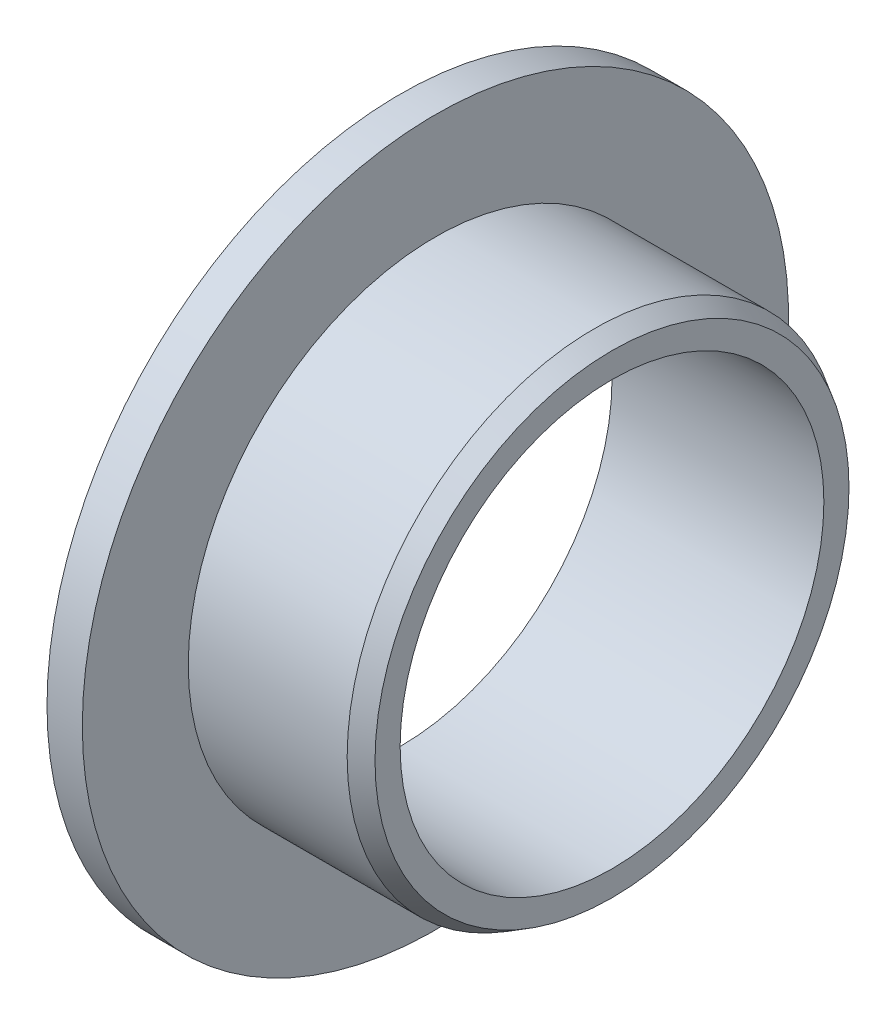
ISO-10303-21;
HEADER;
FILE_DESCRIPTION(('STEP AP214'),'2;1');
FILE_NAME('part.step','',(''),(''),'','','');
FILE_SCHEMA(('AUTOMOTIVE_DESIGN { 1 0 10303 214 1 1 1 1 }'));
ENDSEC;
DATA;
#1=APPLICATION_CONTEXT('core data for automotive mechanical design processes');
#2=APPLICATION_PROTOCOL_DEFINITION('international standard','automotive_design',2000,#1);
#3=PRODUCT_CONTEXT('',#1,'mechanical');
#4=PRODUCT('Part','Part','',(#3));
#5=PRODUCT_RELATED_PRODUCT_CATEGORY('part','',(#4));
#6=PRODUCT_DEFINITION_FORMATION('','',#4);
#7=PRODUCT_DEFINITION_CONTEXT('part definition',#1,'design');
#8=PRODUCT_DEFINITION('design','',#6,#7);
#9=PRODUCT_DEFINITION_SHAPE('','',#8);
#10=(LENGTH_UNIT() NAMED_UNIT(*) SI_UNIT(.MILLI.,.METRE.));
#11=(NAMED_UNIT(*) PLANE_ANGLE_UNIT() SI_UNIT($,.RADIAN.));
#12=(NAMED_UNIT(*) SI_UNIT($,.STERADIAN.) SOLID_ANGLE_UNIT());
#13=UNCERTAINTY_MEASURE_WITH_UNIT(LENGTH_MEASURE(1.E-05),#10,'distance_accuracy_value','');
#14=(GEOMETRIC_REPRESENTATION_CONTEXT(3) GLOBAL_UNCERTAINTY_ASSIGNED_CONTEXT((#13)) GLOBAL_UNIT_ASSIGNED_CONTEXT((#10,
#11,#12)) REPRESENTATION_CONTEXT('',''));
#15=CARTESIAN_POINT('',(0.,0.,0.));
#16=DIRECTION('',(0.,0.,1.));
#17=DIRECTION('',(1.,0.,0.));
#18=AXIS2_PLACEMENT_3D('',#15,#16,#17);
#19=CARTESIAN_POINT('',(0.,6.,0.));
#20=DIRECTION('',(1.,0.,0.));
#21=DIRECTION('',(0.,0.,-1.));
#22=AXIS2_PLACEMENT_3D('',#19,#20,#21);
#23=PLANE('',#22);
#24=CARTESIAN_POINT('',(0.,0.,0.));
#25=DIRECTION('',(-1.,0.,0.));
#26=DIRECTION('',(0.,0.,1.));
#27=AXIS2_PLACEMENT_3D('',#24,#25,#26);
#28=CIRCLE('',#27,6.);
#29=CARTESIAN_POINT('',(0.,0.,6.));
#30=VERTEX_POINT('',#29);
#31=EDGE_CURVE('E65',#30,#30,#28,.T.);
#32=ORIENTED_EDGE('',*,*,#31,.F.);
#33=EDGE_LOOP('',(#32));
#34=FACE_BOUND('',#33,.T.);
#35=CARTESIAN_POINT('',(0.,0.,0.));
#36=DIRECTION('',(-1.,0.,0.));
#37=DIRECTION('',(0.,0.,1.));
#38=AXIS2_PLACEMENT_3D('',#35,#36,#37);
#39=CIRCLE('',#38,10.);
#40=CARTESIAN_POINT('',(0.,0.,10.));
#41=VERTEX_POINT('',#40);
#42=EDGE_CURVE('E50',#41,#41,#39,.T.);
#43=ORIENTED_EDGE('',*,*,#42,.T.);
#44=EDGE_LOOP('',(#43));
#45=FACE_BOUND('',#44,.T.);
#46=ADVANCED_FACE('F38',(#34,#45),#23,.F.);
#47=CARTESIAN_POINT('',(0.,0.,0.));
#48=DIRECTION('',(-1.,0.,0.));
#49=DIRECTION('',(0.,0.,1.));
#50=AXIS2_PLACEMENT_3D('',#47,#48,#49);
#51=CYLINDRICAL_SURFACE('',#50,10.);
#52=ORIENTED_EDGE('',*,*,#42,.F.);
#53=EDGE_LOOP('',(#52));
#54=FACE_BOUND('',#53,.T.);
#55=CARTESIAN_POINT('',(1.,0.,0.));
#56=DIRECTION('',(-1.,0.,0.));
#57=DIRECTION('',(0.,0.,1.));
#58=AXIS2_PLACEMENT_3D('',#55,#56,#57);
#59=CIRCLE('',#58,10.);
#60=CARTESIAN_POINT('',(1.,0.,10.));
#61=VERTEX_POINT('',#60);
#62=EDGE_CURVE('E54',#61,#61,#59,.T.);
#63=ORIENTED_EDGE('',*,*,#62,.T.);
#64=EDGE_LOOP('',(#63));
#65=FACE_BOUND('',#64,.T.);
#66=ADVANCED_FACE('F73',(#54,#65),#51,.T.);
#67=CARTESIAN_POINT('',(1.,10.,0.));
#68=DIRECTION('',(-1.,0.,0.));
#69=DIRECTION('',(0.,0.,1.));
#70=AXIS2_PLACEMENT_3D('',#67,#68,#69);
#71=PLANE('',#70);
#72=ORIENTED_EDGE('',*,*,#62,.F.);
#73=EDGE_LOOP('',(#72));
#74=FACE_BOUND('',#73,.T.);
#75=CARTESIAN_POINT('',(1.,0.,0.));
#76=DIRECTION('',(-1.,0.,0.));
#77=DIRECTION('',(0.,0.,1.));
#78=AXIS2_PLACEMENT_3D('',#75,#76,#77);
#79=CIRCLE('',#78,7.);
#80=CARTESIAN_POINT('',(1.,0.,7.));
#81=VERTEX_POINT('',#80);
#82=EDGE_CURVE('E59',#81,#81,#79,.T.);
#83=ORIENTED_EDGE('',*,*,#82,.T.);
#84=EDGE_LOOP('',(#83));
#85=FACE_BOUND('',#84,.T.);
#86=ADVANCED_FACE('F78',(#74,#85),#71,.F.);
#87=CARTESIAN_POINT('',(0.,0.,0.));
#88=DIRECTION('',(-1.,0.,0.));
#89=DIRECTION('',(0.,0.,1.));
#90=AXIS2_PLACEMENT_3D('',#87,#88,#89);
#91=CYLINDRICAL_SURFACE('',#90,7.);
#92=CARTESIAN_POINT('',(5.49999999999999,0.,0.));
#93=DIRECTION('',(-1.,0.,0.));
#94=DIRECTION('',(0.,0.,1.));
#95=AXIS2_PLACEMENT_3D('',#92,#93,#94);
#96=CIRCLE('',#95,7.);
#97=CARTESIAN_POINT('',(5.49999999999999,0.,7.));
#98=VERTEX_POINT('',#97);
#99=EDGE_CURVE('E46',#98,#98,#96,.T.);
#100=ORIENTED_EDGE('',*,*,#99,.T.);
#101=EDGE_LOOP('',(#100));
#102=FACE_BOUND('',#101,.T.);
#103=ORIENTED_EDGE('',*,*,#82,.F.);
#104=EDGE_LOOP('',(#103));
#105=FACE_BOUND('',#104,.T.);
#106=ADVANCED_FACE('F84',(#102,#105),#91,.T.);
#107=CARTESIAN_POINT('',(6.,6.,0.));
#108=DIRECTION('',(-1.,0.,0.));
#109=DIRECTION('',(0.,0.,1.));
#110=AXIS2_PLACEMENT_3D('',#107,#108,#109);
#111=PLANE('',#110);
#112=CARTESIAN_POINT('',(6.,0.,0.));
#113=DIRECTION('',(-1.,0.,0.));
#114=DIRECTION('',(0.,0.,1.));
#115=AXIS2_PLACEMENT_3D('',#112,#113,#114);
#116=CIRCLE('',#115,6.71132486540518);
#117=CARTESIAN_POINT('',(6.,0.,6.71132486540518));
#118=VERTEX_POINT('',#117);
#119=EDGE_CURVE('E10',#118,#118,#116,.F.);
#120=ORIENTED_EDGE('',*,*,#119,.T.);
#121=EDGE_LOOP('',(#120));
#122=FACE_BOUND('',#121,.T.);
#123=CARTESIAN_POINT('',(6.,0.,0.));
#124=DIRECTION('',(-1.,0.,0.));
#125=DIRECTION('',(0.,0.,1.));
#126=AXIS2_PLACEMENT_3D('',#123,#124,#125);
#127=CIRCLE('',#126,6.);
#128=CARTESIAN_POINT('',(6.,0.,6.));
#129=VERTEX_POINT('',#128);
#130=EDGE_CURVE('E62',#129,#129,#127,.T.);
#131=ORIENTED_EDGE('',*,*,#130,.T.);
#132=EDGE_LOOP('',(#131));
#133=FACE_BOUND('',#132,.T.);
#134=ADVANCED_FACE('F89',(#122,#133),#111,.F.);
#135=CARTESIAN_POINT('',(0.,0.,0.));
#136=DIRECTION('',(-1.,0.,0.));
#137=DIRECTION('',(0.,0.,1.));
#138=AXIS2_PLACEMENT_3D('',#135,#136,#137);
#139=CYLINDRICAL_SURFACE('',#138,6.);
#140=ORIENTED_EDGE('',*,*,#130,.F.);
#141=EDGE_LOOP('',(#140));
#142=FACE_BOUND('',#141,.T.);
#143=ORIENTED_EDGE('',*,*,#31,.T.);
#144=EDGE_LOOP('',(#143));
#145=FACE_BOUND('',#144,.T.);
#146=ADVANCED_FACE('F69',(#142,#145),#139,.F.);
#147=CARTESIAN_POINT('',(5.49999999999999,0.,0.));
#148=DIRECTION('',(-1.,0.,0.));
#149=DIRECTION('',(0.,0.,1.));
#150=AXIS2_PLACEMENT_3D('',#147,#148,#149);
#151=CONICAL_SURFACE('',#150,7.,0.523598775598299);
#152=ORIENTED_EDGE('',*,*,#119,.F.);
#153=EDGE_LOOP('',(#152));
#154=FACE_BOUND('',#153,.T.);
#155=ORIENTED_EDGE('',*,*,#99,.F.);
#156=EDGE_LOOP('',(#155));
#157=FACE_BOUND('',#156,.T.);
#158=ADVANCED_FACE('F41',(#154,#157),#151,.T.);
#159=CLOSED_SHELL('',(#46,#66,#86,#106,#134,#146,#158));
#160=MANIFOLD_SOLID_BREP('B2',#159);
#161=ADVANCED_BREP_SHAPE_REPRESENTATION('',(#18,#160),#14);
#162=SHAPE_DEFINITION_REPRESENTATION(#9,#161);
ENDSEC;
END-ISO-10303-21;
